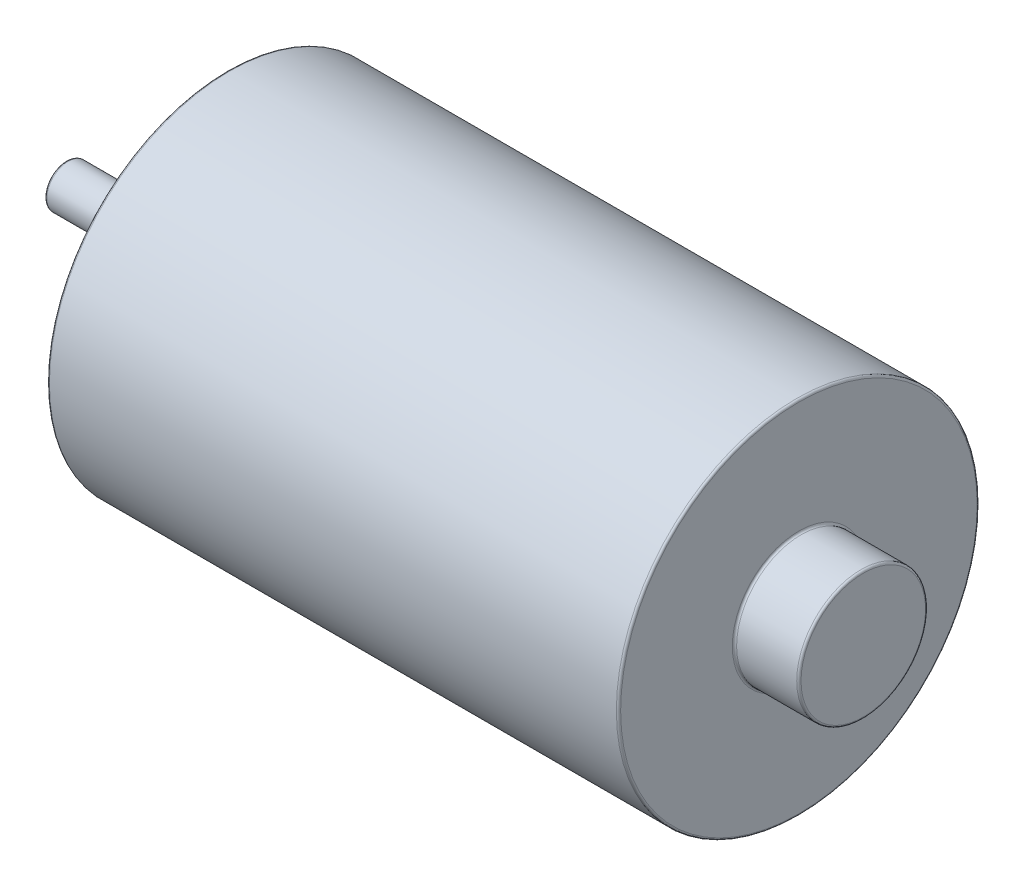
ISO-10303-21;
HEADER;
FILE_DESCRIPTION(('STEP AP214'),'2;1');
FILE_NAME('part.step','',(''),(''),'','','');
FILE_SCHEMA(('AUTOMOTIVE_DESIGN { 1 0 10303 214 1 1 1 1 }'));
ENDSEC;
DATA;
#1=APPLICATION_CONTEXT('core data for automotive mechanical design processes');
#2=APPLICATION_PROTOCOL_DEFINITION('international standard','automotive_design',2000,#1);
#3=PRODUCT_CONTEXT('',#1,'mechanical');
#4=PRODUCT('Part','Part','',(#3));
#5=PRODUCT_RELATED_PRODUCT_CATEGORY('part','',(#4));
#6=PRODUCT_DEFINITION_FORMATION('','',#4);
#7=PRODUCT_DEFINITION_CONTEXT('part definition',#1,'design');
#8=PRODUCT_DEFINITION('design','',#6,#7);
#9=PRODUCT_DEFINITION_SHAPE('','',#8);
#10=(LENGTH_UNIT() NAMED_UNIT(*) SI_UNIT(.MILLI.,.METRE.));
#11=(NAMED_UNIT(*) PLANE_ANGLE_UNIT() SI_UNIT($,.RADIAN.));
#12=(NAMED_UNIT(*) SI_UNIT($,.STERADIAN.) SOLID_ANGLE_UNIT());
#13=UNCERTAINTY_MEASURE_WITH_UNIT(LENGTH_MEASURE(1.E-05),#10,'distance_accuracy_value','');
#14=(GEOMETRIC_REPRESENTATION_CONTEXT(3) GLOBAL_UNCERTAINTY_ASSIGNED_CONTEXT((#13)) GLOBAL_UNIT_ASSIGNED_CONTEXT((#10,
#11,#12)) REPRESENTATION_CONTEXT('',''));
#15=CARTESIAN_POINT('',(0.,0.,0.));
#16=DIRECTION('',(0.,0.,1.));
#17=DIRECTION('',(1.,0.,0.));
#18=AXIS2_PLACEMENT_3D('',#15,#16,#17);
#19=CARTESIAN_POINT('',(-47.800000000001,0.,0.));
#20=DIRECTION('',(-1.,0.,0.));
#21=DIRECTION('',(0.,0.,1.));
#22=AXIS2_PLACEMENT_3D('',#19,#20,#21);
#23=CYLINDRICAL_SURFACE('',#22,2.50000000000017);
#24=CARTESIAN_POINT('',(-33.2500000000007,0.,0.));
#25=DIRECTION('',(1.,0.,0.));
#26=DIRECTION('',(0.,0.,-1.));
#27=AXIS2_PLACEMENT_3D('',#24,#25,#26);
#28=CIRCLE('',#27,2.50000000000017);
#29=CARTESIAN_POINT('',(-33.2500000000007,0.,-2.50000000000017));
#30=VERTEX_POINT('',#29);
#31=EDGE_CURVE('E64',#30,#30,#28,.F.);
#32=ORIENTED_EDGE('',*,*,#31,.T.);
#33=EDGE_LOOP('',(#32));
#34=FACE_BOUND('',#33,.T.);
#35=CARTESIAN_POINT('',(-47.550000000001,0.,0.));
#36=DIRECTION('',(1.,0.,0.));
#37=DIRECTION('',(0.,0.,-1.));
#38=AXIS2_PLACEMENT_3D('',#35,#36,#37);
#39=CIRCLE('',#38,2.50000000000017);
#40=CARTESIAN_POINT('',(-47.550000000001,0.,-2.50000000000017));
#41=VERTEX_POINT('',#40);
#42=EDGE_CURVE('E67',#41,#41,#39,.T.);
#43=ORIENTED_EDGE('',*,*,#42,.T.);
#44=EDGE_LOOP('',(#43));
#45=FACE_BOUND('',#44,.T.);
#46=ADVANCED_FACE('F32',(#34,#45),#23,.T.);
#47=CARTESIAN_POINT('',(-33.0000000000007,8.50000000000017,0.));
#48=DIRECTION('',(1.,0.,0.));
#49=DIRECTION('',(0.,0.,-1.));
#50=AXIS2_PLACEMENT_3D('',#47,#48,#49);
#51=PLANE('',#50);
#52=CARTESIAN_POINT('',(-33.0000000000007,0.,0.));
#53=DIRECTION('',(1.,0.,0.));
#54=DIRECTION('',(0.,0.,-1.));
#55=AXIS2_PLACEMENT_3D('',#52,#53,#54);
#56=CIRCLE('',#55,2.75000000000017);
#57=CARTESIAN_POINT('',(-33.0000000000007,0.,-2.75000000000017));
#58=VERTEX_POINT('',#57);
#59=EDGE_CURVE('E58',#58,#58,#56,.T.);
#60=ORIENTED_EDGE('',*,*,#59,.T.);
#61=EDGE_LOOP('',(#60));
#62=FACE_BOUND('',#61,.T.);
#63=CARTESIAN_POINT('',(-33.0000000000007,0.,0.));
#64=DIRECTION('',(1.,0.,0.));
#65=DIRECTION('',(0.,0.,-1.));
#66=AXIS2_PLACEMENT_3D('',#63,#64,#65);
#67=CIRCLE('',#66,8.25000000000017);
#68=CARTESIAN_POINT('',(-33.0000000000007,0.,-8.25000000000017));
#69=VERTEX_POINT('',#68);
#70=EDGE_CURVE('E61',#69,#69,#67,.F.);
#71=ORIENTED_EDGE('',*,*,#70,.T.);
#72=EDGE_LOOP('',(#71));
#73=FACE_BOUND('',#72,.T.);
#74=ADVANCED_FACE('F131',(#62,#73),#51,.F.);
#75=CARTESIAN_POINT('',(-47.800000000001,0.,0.));
#76=DIRECTION('',(-1.,0.,0.));
#77=DIRECTION('',(0.,0.,1.));
#78=AXIS2_PLACEMENT_3D('',#75,#76,#77);
#79=CYLINDRICAL_SURFACE('',#78,8.50000000000017);
#80=CARTESIAN_POINT('',(-32.7500000000007,0.,0.));
#81=DIRECTION('',(1.,0.,0.));
#82=DIRECTION('',(0.,0.,-1.));
#83=AXIS2_PLACEMENT_3D('',#80,#81,#82);
#84=CIRCLE('',#83,8.50000000000017);
#85=CARTESIAN_POINT('',(-32.7500000000007,0.,-8.50000000000017));
#86=VERTEX_POINT('',#85);
#87=EDGE_CURVE('E47',#86,#86,#84,.T.);
#88=ORIENTED_EDGE('',*,*,#87,.T.);
#89=EDGE_LOOP('',(#88));
#90=FACE_BOUND('',#89,.T.);
#91=CARTESIAN_POINT('',(-29.2500000000004,0.,0.));
#92=DIRECTION('',(1.,0.,0.));
#93=DIRECTION('',(0.,0.,-1.));
#94=AXIS2_PLACEMENT_3D('',#91,#92,#93);
#95=CIRCLE('',#94,8.50000000000017);
#96=CARTESIAN_POINT('',(-29.2500000000004,0.,-8.50000000000017));
#97=VERTEX_POINT('',#96);
#98=EDGE_CURVE('E52',#97,#97,#95,.F.);
#99=ORIENTED_EDGE('',*,*,#98,.T.);
#100=EDGE_LOOP('',(#99));
#101=FACE_BOUND('',#100,.T.);
#102=ADVANCED_FACE('F114',(#90,#101),#79,.T.);
#103=CARTESIAN_POINT('',(-29.0000000000004,21.0000000000001,0.));
#104=DIRECTION('',(1.,0.,0.));
#105=DIRECTION('',(0.,0.,-1.));
#106=AXIS2_PLACEMENT_3D('',#103,#104,#105);
#107=PLANE('',#106);
#108=CARTESIAN_POINT('',(-29.0000000000004,14.5000000000001,0.));
#109=DIRECTION('',(-1.,0.,0.));
#110=DIRECTION('',(0.,0.,1.));
#111=AXIS2_PLACEMENT_3D('',#108,#109,#110);
#112=CIRCLE('',#111,1.99999999999978);
#113=CARTESIAN_POINT('',(-29.0000000000004,14.5000000000001,1.99999999999978));
#114=VERTEX_POINT('',#113);
#115=EDGE_CURVE('E95',#114,#114,#112,.T.);
#116=ORIENTED_EDGE('',*,*,#115,.F.);
#117=EDGE_LOOP('',(#116));
#118=FACE_BOUND('',#117,.T.);
#119=CARTESIAN_POINT('',(-29.0000000000004,-14.5,0.));
#120=DIRECTION('',(-1.,0.,0.));
#121=DIRECTION('',(0.,0.,1.));
#122=AXIS2_PLACEMENT_3D('',#119,#120,#121);
#123=CIRCLE('',#122,1.99999999999978);
#124=CARTESIAN_POINT('',(-29.0000000000004,-14.5,1.99999999999978));
#125=VERTEX_POINT('',#124);
#126=EDGE_CURVE('E89',#125,#125,#123,.T.);
#127=ORIENTED_EDGE('',*,*,#126,.F.);
#128=EDGE_LOOP('',(#127));
#129=FACE_BOUND('',#128,.T.);
#130=CARTESIAN_POINT('',(-29.0000000000004,0.,0.));
#131=DIRECTION('',(1.,0.,0.));
#132=DIRECTION('',(0.,0.,-1.));
#133=AXIS2_PLACEMENT_3D('',#130,#131,#132);
#134=CIRCLE('',#133,20.7500000000001);
#135=CARTESIAN_POINT('',(-29.0000000000004,0.,-20.7500000000001));
#136=VERTEX_POINT('',#135);
#137=EDGE_CURVE('E70',#136,#136,#134,.F.);
#138=ORIENTED_EDGE('',*,*,#137,.T.);
#139=EDGE_LOOP('',(#138));
#140=FACE_BOUND('',#139,.T.);
#141=CARTESIAN_POINT('',(-29.0000000000004,0.,0.));
#142=DIRECTION('',(1.,0.,0.));
#143=DIRECTION('',(0.,0.,-1.));
#144=AXIS2_PLACEMENT_3D('',#141,#142,#143);
#145=CIRCLE('',#144,8.75000000000017);
#146=CARTESIAN_POINT('',(-29.0000000000004,0.,-8.75000000000017));
#147=VERTEX_POINT('',#146);
#148=EDGE_CURVE('E73',#147,#147,#145,.T.);
#149=ORIENTED_EDGE('',*,*,#148,.T.);
#150=EDGE_LOOP('',(#149));
#151=FACE_BOUND('',#150,.T.);
#152=ADVANCED_FACE('F110',(#118,#129,#140,#151),#107,.F.);
#153=CARTESIAN_POINT('',(-47.800000000001,0.,0.));
#154=DIRECTION('',(-1.,0.,0.));
#155=DIRECTION('',(0.,0.,1.));
#156=AXIS2_PLACEMENT_3D('',#153,#154,#155);
#157=CYLINDRICAL_SURFACE('',#156,21.0000000000001);
#158=CARTESIAN_POINT('',(37.2499999999996,0.,0.));
#159=DIRECTION('',(-1.,0.,0.));
#160=DIRECTION('',(0.,0.,1.));
#161=AXIS2_PLACEMENT_3D('',#158,#159,#160);
#162=CIRCLE('',#161,21.0000000000001);
#163=CARTESIAN_POINT('',(37.2499999999996,0.,21.0000000000001));
#164=VERTEX_POINT('',#163);
#165=EDGE_CURVE('E82',#164,#164,#162,.T.);
#166=ORIENTED_EDGE('',*,*,#165,.T.);
#167=EDGE_LOOP('',(#166));
#168=FACE_BOUND('',#167,.T.);
#169=CARTESIAN_POINT('',(-28.7500000000004,0.,0.));
#170=DIRECTION('',(1.,0.,0.));
#171=DIRECTION('',(0.,0.,-1.));
#172=AXIS2_PLACEMENT_3D('',#169,#170,#171);
#173=CIRCLE('',#172,21.0000000000001);
#174=CARTESIAN_POINT('',(-28.7500000000004,0.,-21.0000000000001));
#175=VERTEX_POINT('',#174);
#176=EDGE_CURVE('E85',#175,#175,#173,.T.);
#177=ORIENTED_EDGE('',*,*,#176,.T.);
#178=EDGE_LOOP('',(#177));
#179=FACE_BOUND('',#178,.T.);
#180=ADVANCED_FACE('F113',(#168,#179),#157,.T.);
#181=CARTESIAN_POINT('',(37.4999999999996,21.0000000000001,0.));
#182=DIRECTION('',(-1.,0.,0.));
#183=DIRECTION('',(0.,0.,1.));
#184=AXIS2_PLACEMENT_3D('',#181,#182,#183);
#185=PLANE('',#184);
#186=CARTESIAN_POINT('',(37.4999999999996,0.,0.));
#187=DIRECTION('',(-1.,0.,0.));
#188=DIRECTION('',(0.,0.,1.));
#189=AXIS2_PLACEMENT_3D('',#186,#187,#188);
#190=CIRCLE('',#189,20.7500000000001);
#191=CARTESIAN_POINT('',(37.4999999999996,0.,20.7500000000001));
#192=VERTEX_POINT('',#191);
#193=EDGE_CURVE('E76',#192,#192,#190,.F.);
#194=ORIENTED_EDGE('',*,*,#193,.T.);
#195=EDGE_LOOP('',(#194));
#196=FACE_BOUND('',#195,.T.);
#197=CARTESIAN_POINT('',(37.4999999999996,0.,0.));
#198=DIRECTION('',(-1.,0.,0.));
#199=DIRECTION('',(0.,0.,1.));
#200=AXIS2_PLACEMENT_3D('',#197,#198,#199);
#201=CIRCLE('',#200,7.75000000000017);
#202=CARTESIAN_POINT('',(37.4999999999996,0.,7.75000000000017));
#203=VERTEX_POINT('',#202);
#204=EDGE_CURVE('E79',#203,#203,#201,.T.);
#205=ORIENTED_EDGE('',*,*,#204,.T.);
#206=EDGE_LOOP('',(#205));
#207=FACE_BOUND('',#206,.T.);
#208=ADVANCED_FACE('F182',(#196,#207),#185,.F.);
#209=CARTESIAN_POINT('',(-47.800000000001,0.,0.));
#210=DIRECTION('',(-1.,0.,0.));
#211=DIRECTION('',(0.,0.,1.));
#212=AXIS2_PLACEMENT_3D('',#209,#210,#211);
#213=CYLINDRICAL_SURFACE('',#212,7.50000000000017);
#214=CARTESIAN_POINT('',(44.749999999999,0.,0.));
#215=DIRECTION('',(-1.,0.,0.));
#216=DIRECTION('',(0.,0.,1.));
#217=AXIS2_PLACEMENT_3D('',#214,#215,#216);
#218=CIRCLE('',#217,7.50000000000017);
#219=CARTESIAN_POINT('',(44.749999999999,0.,7.50000000000017));
#220=VERTEX_POINT('',#219);
#221=EDGE_CURVE('E39',#220,#220,#218,.T.);
#222=ORIENTED_EDGE('',*,*,#221,.T.);
#223=EDGE_LOOP('',(#222));
#224=FACE_BOUND('',#223,.T.);
#225=CARTESIAN_POINT('',(37.7499999999996,0.,0.));
#226=DIRECTION('',(-1.,0.,0.));
#227=DIRECTION('',(0.,0.,1.));
#228=AXIS2_PLACEMENT_3D('',#225,#226,#227);
#229=CIRCLE('',#228,7.50000000000017);
#230=CARTESIAN_POINT('',(37.7499999999996,0.,7.50000000000017));
#231=VERTEX_POINT('',#230);
#232=EDGE_CURVE('E43',#231,#231,#229,.F.);
#233=ORIENTED_EDGE('',*,*,#232,.T.);
#234=EDGE_LOOP('',(#233));
#235=FACE_BOUND('',#234,.T.);
#236=ADVANCED_FACE('F184',(#224,#235),#213,.T.);
#237=CARTESIAN_POINT('',(44.999999999999,7.50000000000017,0.));
#238=DIRECTION('',(-1.,0.,0.));
#239=DIRECTION('',(0.,0.,1.));
#240=AXIS2_PLACEMENT_3D('',#237,#238,#239);
#241=PLANE('',#240);
#242=CARTESIAN_POINT('',(44.999999999999,0.,0.));
#243=DIRECTION('',(-1.,0.,0.));
#244=DIRECTION('',(0.,0.,1.));
#245=AXIS2_PLACEMENT_3D('',#242,#243,#244);
#246=CIRCLE('',#245,7.25000000000017);
#247=CARTESIAN_POINT('',(44.999999999999,0.,7.25000000000017));
#248=VERTEX_POINT('',#247);
#249=EDGE_CURVE('E10',#248,#248,#246,.F.);
#250=ORIENTED_EDGE('',*,*,#249,.T.);
#251=EDGE_LOOP('',(#250));
#252=FACE_BOUND('',#251,.T.);
#253=ADVANCED_FACE('F191',(#252),#241,.F.);
#254=CARTESIAN_POINT('',(-47.800000000001,2.50000000000017,0.));
#255=DIRECTION('',(1.,0.,0.));
#256=DIRECTION('',(0.,0.,-1.));
#257=AXIS2_PLACEMENT_3D('',#254,#255,#256);
#258=PLANE('',#257);
#259=CARTESIAN_POINT('',(-47.800000000001,0.,0.));
#260=DIRECTION('',(1.,0.,0.));
#261=DIRECTION('',(0.,0.,-1.));
#262=AXIS2_PLACEMENT_3D('',#259,#260,#261);
#263=CIRCLE('',#262,2.25000000000017);
#264=CARTESIAN_POINT('',(-47.800000000001,0.,-2.25000000000017));
#265=VERTEX_POINT('',#264);
#266=EDGE_CURVE('E55',#265,#265,#263,.F.);
#267=ORIENTED_EDGE('',*,*,#266,.T.);
#268=EDGE_LOOP('',(#267));
#269=FACE_BOUND('',#268,.T.);
#270=ADVANCED_FACE('F150',(#269),#258,.F.);
#271=CARTESIAN_POINT('',(37.2499999999996,0.,0.));
#272=DIRECTION('',(-1.,0.,0.));
#273=DIRECTION('',(0.,0.,1.));
#274=AXIS2_PLACEMENT_3D('',#271,#272,#273);
#275=TOROIDAL_SURFACE('',#274,20.7500000000001,0.25);
#276=ORIENTED_EDGE('',*,*,#193,.F.);
#277=EDGE_LOOP('',(#276));
#278=FACE_BOUND('',#277,.T.);
#279=ORIENTED_EDGE('',*,*,#165,.F.);
#280=EDGE_LOOP('',(#279));
#281=FACE_BOUND('',#280,.T.);
#282=ADVANCED_FACE('F146',(#278,#281),#275,.T.);
#283=CARTESIAN_POINT('',(-28.7500000000004,0.,0.));
#284=DIRECTION('',(1.,0.,0.));
#285=DIRECTION('',(0.,0.,-1.));
#286=AXIS2_PLACEMENT_3D('',#283,#284,#285);
#287=TOROIDAL_SURFACE('',#286,20.7500000000001,0.25);
#288=ORIENTED_EDGE('',*,*,#176,.F.);
#289=EDGE_LOOP('',(#288));
#290=FACE_BOUND('',#289,.T.);
#291=ORIENTED_EDGE('',*,*,#137,.F.);
#292=EDGE_LOOP('',(#291));
#293=FACE_BOUND('',#292,.T.);
#294=ADVANCED_FACE('F149',(#290,#293),#287,.T.);
#295=CARTESIAN_POINT('',(-33.2500000000007,0.,0.));
#296=DIRECTION('',(1.,0.,0.));
#297=DIRECTION('',(0.,0.,-1.));
#298=AXIS2_PLACEMENT_3D('',#295,#296,#297);
#299=TOROIDAL_SURFACE('',#298,2.75000000000017,0.25);
#300=ORIENTED_EDGE('',*,*,#59,.F.);
#301=EDGE_LOOP('',(#300));
#302=FACE_BOUND('',#301,.T.);
#303=ORIENTED_EDGE('',*,*,#31,.F.);
#304=EDGE_LOOP('',(#303));
#305=FACE_BOUND('',#304,.T.);
#306=ADVANCED_FACE('F154',(#302,#305),#299,.F.);
#307=CARTESIAN_POINT('',(-47.550000000001,0.,0.));
#308=DIRECTION('',(1.,0.,0.));
#309=DIRECTION('',(0.,0.,-1.));
#310=AXIS2_PLACEMENT_3D('',#307,#308,#309);
#311=TOROIDAL_SURFACE('',#310,2.25000000000017,0.25);
#312=ORIENTED_EDGE('',*,*,#42,.F.);
#313=EDGE_LOOP('',(#312));
#314=FACE_BOUND('',#313,.T.);
#315=ORIENTED_EDGE('',*,*,#266,.F.);
#316=EDGE_LOOP('',(#315));
#317=FACE_BOUND('',#316,.T.);
#318=ADVANCED_FACE('F158',(#314,#317),#311,.T.);
#319=CARTESIAN_POINT('',(-32.7500000000007,0.,0.));
#320=DIRECTION('',(1.,0.,0.));
#321=DIRECTION('',(0.,0.,-1.));
#322=AXIS2_PLACEMENT_3D('',#319,#320,#321);
#323=TOROIDAL_SURFACE('',#322,8.25000000000017,0.25);
#324=ORIENTED_EDGE('',*,*,#87,.F.);
#325=EDGE_LOOP('',(#324));
#326=FACE_BOUND('',#325,.T.);
#327=ORIENTED_EDGE('',*,*,#70,.F.);
#328=EDGE_LOOP('',(#327));
#329=FACE_BOUND('',#328,.T.);
#330=ADVANCED_FACE('F126',(#326,#329),#323,.T.);
#331=CARTESIAN_POINT('',(-29.2500000000004,0.,0.));
#332=DIRECTION('',(1.,0.,0.));
#333=DIRECTION('',(0.,0.,-1.));
#334=AXIS2_PLACEMENT_3D('',#331,#332,#333);
#335=TOROIDAL_SURFACE('',#334,8.75000000000017,0.25);
#336=ORIENTED_EDGE('',*,*,#148,.F.);
#337=EDGE_LOOP('',(#336));
#338=FACE_BOUND('',#337,.T.);
#339=ORIENTED_EDGE('',*,*,#98,.F.);
#340=EDGE_LOOP('',(#339));
#341=FACE_BOUND('',#340,.T.);
#342=ADVANCED_FACE('F122',(#338,#341),#335,.F.);
#343=CARTESIAN_POINT('',(44.749999999999,0.,0.));
#344=DIRECTION('',(-1.,0.,0.));
#345=DIRECTION('',(0.,0.,1.));
#346=AXIS2_PLACEMENT_3D('',#343,#344,#345);
#347=TOROIDAL_SURFACE('',#346,7.25000000000017,0.25);
#348=ORIENTED_EDGE('',*,*,#249,.F.);
#349=EDGE_LOOP('',(#348));
#350=FACE_BOUND('',#349,.T.);
#351=ORIENTED_EDGE('',*,*,#221,.F.);
#352=EDGE_LOOP('',(#351));
#353=FACE_BOUND('',#352,.T.);
#354=ADVANCED_FACE('F125',(#350,#353),#347,.T.);
#355=CARTESIAN_POINT('',(37.7499999999996,0.,0.));
#356=DIRECTION('',(-1.,0.,0.));
#357=DIRECTION('',(0.,0.,1.));
#358=AXIS2_PLACEMENT_3D('',#355,#356,#357);
#359=TOROIDAL_SURFACE('',#358,7.75000000000017,0.25);
#360=ORIENTED_EDGE('',*,*,#232,.F.);
#361=EDGE_LOOP('',(#360));
#362=FACE_BOUND('',#361,.T.);
#363=ORIENTED_EDGE('',*,*,#204,.F.);
#364=EDGE_LOOP('',(#363));
#365=FACE_BOUND('',#364,.T.);
#366=ADVANCED_FACE('F34',(#362,#365),#359,.F.);
#367=CARTESIAN_POINT('',(-19.0000000000004,-14.5,0.));
#368=DIRECTION('',(-1.,0.,0.));
#369=DIRECTION('',(0.,0.,1.));
#370=AXIS2_PLACEMENT_3D('',#367,#368,#369);
#371=CYLINDRICAL_SURFACE('',#370,1.99999999999978);
#372=CARTESIAN_POINT('',(-19.0000000000004,-14.5,0.));
#373=DIRECTION('',(-1.,0.,0.));
#374=DIRECTION('',(0.,0.,1.));
#375=AXIS2_PLACEMENT_3D('',#372,#373,#374);
#376=CIRCLE('',#375,1.99999999999978);
#377=CARTESIAN_POINT('',(-19.0000000000004,-14.5,1.99999999999978));
#378=VERTEX_POINT('',#377);
#379=EDGE_CURVE('E92',#378,#378,#376,.T.);
#380=ORIENTED_EDGE('',*,*,#379,.F.);
#381=EDGE_LOOP('',(#380));
#382=FACE_BOUND('',#381,.T.);
#383=ORIENTED_EDGE('',*,*,#126,.T.);
#384=EDGE_LOOP('',(#383));
#385=FACE_BOUND('',#384,.T.);
#386=ADVANCED_FACE('F170',(#382,#385),#371,.F.);
#387=CARTESIAN_POINT('',(-19.0000000000004,-14.5,0.));
#388=DIRECTION('',(-1.,0.,0.));
#389=DIRECTION('',(0.,0.,1.));
#390=AXIS2_PLACEMENT_3D('',#387,#388,#389);
#391=PLANE('',#390);
#392=ORIENTED_EDGE('',*,*,#379,.T.);
#393=EDGE_LOOP('',(#392));
#394=FACE_BOUND('',#393,.T.);
#395=ADVANCED_FACE('F106',(#394),#391,.T.);
#396=CARTESIAN_POINT('',(-19.0000000000004,14.5000000000001,0.));
#397=DIRECTION('',(-1.,0.,0.));
#398=DIRECTION('',(0.,0.,1.));
#399=AXIS2_PLACEMENT_3D('',#396,#397,#398);
#400=CYLINDRICAL_SURFACE('',#399,1.99999999999978);
#401=CARTESIAN_POINT('',(-19.0000000000004,14.5000000000001,0.));
#402=DIRECTION('',(-1.,0.,0.));
#403=DIRECTION('',(0.,0.,1.));
#404=AXIS2_PLACEMENT_3D('',#401,#402,#403);
#405=CIRCLE('',#404,1.99999999999978);
#406=CARTESIAN_POINT('',(-19.0000000000004,14.5000000000001,1.99999999999978));
#407=VERTEX_POINT('',#406);
#408=EDGE_CURVE('E88',#407,#407,#405,.T.);
#409=ORIENTED_EDGE('',*,*,#408,.F.);
#410=EDGE_LOOP('',(#409));
#411=FACE_BOUND('',#410,.T.);
#412=ORIENTED_EDGE('',*,*,#115,.T.);
#413=EDGE_LOOP('',(#412));
#414=FACE_BOUND('',#413,.T.);
#415=ADVANCED_FACE('F103',(#411,#414),#400,.F.);
#416=CARTESIAN_POINT('',(-19.0000000000004,14.5000000000001,0.));
#417=DIRECTION('',(-1.,0.,0.));
#418=DIRECTION('',(0.,0.,1.));
#419=AXIS2_PLACEMENT_3D('',#416,#417,#418);
#420=PLANE('',#419);
#421=ORIENTED_EDGE('',*,*,#408,.T.);
#422=EDGE_LOOP('',(#421));
#423=FACE_BOUND('',#422,.T.);
#424=ADVANCED_FACE('F101',(#423),#420,.T.);
#425=CLOSED_SHELL('',(#46,#74,#102,#152,#180,#208,#236,#253,#270,#282,#294,#306,#318,#330,#342,
#354,#366,#386,#395,#415,#424));
#426=MANIFOLD_SOLID_BREP('B2',#425);
#427=ADVANCED_BREP_SHAPE_REPRESENTATION('',(#18,#426),#14);
#428=SHAPE_DEFINITION_REPRESENTATION(#9,#427);
ENDSEC;
END-ISO-10303-21;
